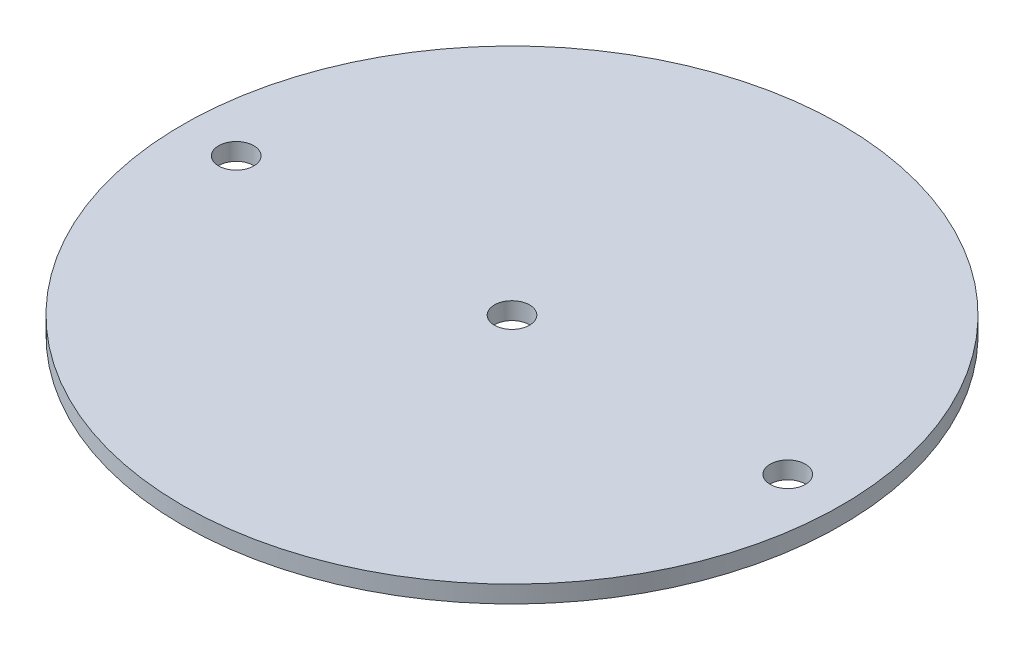
ISO-10303-21;
HEADER;
FILE_DESCRIPTION(('STEP AP214'),'2;1');
FILE_NAME('part.step','',(''),(''),'','','');
FILE_SCHEMA(('AUTOMOTIVE_DESIGN { 1 0 10303 214 1 1 1 1 }'));
ENDSEC;
DATA;
#1=APPLICATION_CONTEXT('core data for automotive mechanical design processes');
#2=APPLICATION_PROTOCOL_DEFINITION('international standard','automotive_design',2000,#1);
#3=PRODUCT_CONTEXT('',#1,'mechanical');
#4=PRODUCT('Part','Part','',(#3));
#5=PRODUCT_RELATED_PRODUCT_CATEGORY('part','',(#4));
#6=PRODUCT_DEFINITION_FORMATION('','',#4);
#7=PRODUCT_DEFINITION_CONTEXT('part definition',#1,'design');
#8=PRODUCT_DEFINITION('design','',#6,#7);
#9=PRODUCT_DEFINITION_SHAPE('','',#8);
#10=(LENGTH_UNIT() NAMED_UNIT(*) SI_UNIT(.MILLI.,.METRE.));
#11=(NAMED_UNIT(*) PLANE_ANGLE_UNIT() SI_UNIT($,.RADIAN.));
#12=(NAMED_UNIT(*) SI_UNIT($,.STERADIAN.) SOLID_ANGLE_UNIT());
#13=UNCERTAINTY_MEASURE_WITH_UNIT(LENGTH_MEASURE(1.E-05),#10,'distance_accuracy_value','');
#14=(GEOMETRIC_REPRESENTATION_CONTEXT(3) GLOBAL_UNCERTAINTY_ASSIGNED_CONTEXT((#13)) GLOBAL_UNIT_ASSIGNED_CONTEXT((#10,
#11,#12)) REPRESENTATION_CONTEXT('',''));
#15=CARTESIAN_POINT('',(0.,0.,0.));
#16=DIRECTION('',(0.,0.,1.));
#17=DIRECTION('',(1.,0.,0.));
#18=AXIS2_PLACEMENT_3D('',#15,#16,#17);
#19=CARTESIAN_POINT('',(0.,3.175,0.));
#20=DIRECTION('',(0.,1.,0.));
#21=DIRECTION('',(0.,0.,1.));
#22=AXIS2_PLACEMENT_3D('',#19,#20,#21);
#23=PLANE('',#22);
#24=CARTESIAN_POINT('',(50.8,3.175,0.));
#25=DIRECTION('',(0.,1.,0.));
#26=DIRECTION('',(0.,0.,1.));
#27=AXIS2_PLACEMENT_3D('',#24,#25,#26);
#28=CIRCLE('',#27,3.2385);
#29=CARTESIAN_POINT('',(50.8,3.175,3.23849999999998));
#30=VERTEX_POINT('',#29);
#31=EDGE_CURVE('E60',#30,#30,#28,.T.);
#32=ORIENTED_EDGE('',*,*,#31,.F.);
#33=EDGE_LOOP('',(#32));
#34=FACE_BOUND('',#33,.T.);
#35=CARTESIAN_POINT('',(0.,3.175,0.));
#36=DIRECTION('',(0.,1.,0.));
#37=DIRECTION('',(0.,0.,1.));
#38=AXIS2_PLACEMENT_3D('',#35,#36,#37);
#39=CIRCLE('',#38,60.706);
#40=CARTESIAN_POINT('',(0.,3.175,60.706));
#41=VERTEX_POINT('',#40);
#42=EDGE_CURVE('E10',#41,#41,#39,.T.);
#43=ORIENTED_EDGE('',*,*,#42,.T.);
#44=EDGE_LOOP('',(#43));
#45=FACE_BOUND('',#44,.T.);
#46=CARTESIAN_POINT('',(-50.8,3.175,0.));
#47=DIRECTION('',(0.,1.,0.));
#48=DIRECTION('',(0.,0.,1.));
#49=AXIS2_PLACEMENT_3D('',#46,#47,#48);
#50=CIRCLE('',#49,3.2385);
#51=CARTESIAN_POINT('',(-50.8,3.175,3.2385));
#52=VERTEX_POINT('',#51);
#53=EDGE_CURVE('E54',#52,#52,#50,.T.);
#54=ORIENTED_EDGE('',*,*,#53,.F.);
#55=EDGE_LOOP('',(#54));
#56=FACE_BOUND('',#55,.T.);
#57=CARTESIAN_POINT('',(0.,3.175,0.));
#58=DIRECTION('',(0.,1.,0.));
#59=DIRECTION('',(0.,0.,1.));
#60=AXIS2_PLACEMENT_3D('',#57,#58,#59);
#61=CIRCLE('',#60,3.2385);
#62=CARTESIAN_POINT('',(0.,3.175,3.2385));
#63=VERTEX_POINT('',#62);
#64=EDGE_CURVE('E68',#63,#63,#61,.T.);
#65=ORIENTED_EDGE('',*,*,#64,.F.);
#66=EDGE_LOOP('',(#65));
#67=FACE_BOUND('',#66,.T.);
#68=ADVANCED_FACE('F41',(#34,#45,#56,#67),#23,.T.);
#69=CARTESIAN_POINT('',(0.,0.,0.));
#70=DIRECTION('',(0.,1.,0.));
#71=DIRECTION('',(0.,0.,1.));
#72=AXIS2_PLACEMENT_3D('',#69,#70,#71);
#73=PLANE('',#72);
#74=CARTESIAN_POINT('',(0.,0.,0.));
#75=DIRECTION('',(0.,1.,0.));
#76=DIRECTION('',(0.,0.,1.));
#77=AXIS2_PLACEMENT_3D('',#74,#75,#76);
#78=CIRCLE('',#77,60.706);
#79=CARTESIAN_POINT('',(0.,0.,60.706));
#80=VERTEX_POINT('',#79);
#81=EDGE_CURVE('E45',#80,#80,#78,.T.);
#82=ORIENTED_EDGE('',*,*,#81,.F.);
#83=EDGE_LOOP('',(#82));
#84=FACE_BOUND('',#83,.T.);
#85=CARTESIAN_POINT('',(-50.8,0.,0.));
#86=DIRECTION('',(0.,1.,0.));
#87=DIRECTION('',(0.,0.,1.));
#88=AXIS2_PLACEMENT_3D('',#85,#86,#87);
#89=CIRCLE('',#88,3.2385);
#90=CARTESIAN_POINT('',(-50.8,0.,3.2385));
#91=VERTEX_POINT('',#90);
#92=EDGE_CURVE('E56',#91,#91,#89,.T.);
#93=ORIENTED_EDGE('',*,*,#92,.T.);
#94=EDGE_LOOP('',(#93));
#95=FACE_BOUND('',#94,.T.);
#96=CARTESIAN_POINT('',(50.8,0.,0.));
#97=DIRECTION('',(0.,1.,0.));
#98=DIRECTION('',(0.,0.,1.));
#99=AXIS2_PLACEMENT_3D('',#96,#97,#98);
#100=CIRCLE('',#99,3.2385);
#101=CARTESIAN_POINT('',(50.8,0.,3.23849999999998));
#102=VERTEX_POINT('',#101);
#103=EDGE_CURVE('E64',#102,#102,#100,.T.);
#104=ORIENTED_EDGE('',*,*,#103,.T.);
#105=EDGE_LOOP('',(#104));
#106=FACE_BOUND('',#105,.T.);
#107=CARTESIAN_POINT('',(0.,0.,0.));
#108=DIRECTION('',(0.,1.,0.));
#109=DIRECTION('',(0.,0.,1.));
#110=AXIS2_PLACEMENT_3D('',#107,#108,#109);
#111=CIRCLE('',#110,3.2385);
#112=CARTESIAN_POINT('',(0.,0.,3.2385));
#113=VERTEX_POINT('',#112);
#114=EDGE_CURVE('E72',#113,#113,#111,.T.);
#115=ORIENTED_EDGE('',*,*,#114,.T.);
#116=EDGE_LOOP('',(#115));
#117=FACE_BOUND('',#116,.T.);
#118=ADVANCED_FACE('F84',(#84,#95,#106,#117),#73,.F.);
#119=CARTESIAN_POINT('',(0.,3.175,0.));
#120=DIRECTION('',(0.,-1.,0.));
#121=DIRECTION('',(0.,0.,-1.));
#122=AXIS2_PLACEMENT_3D('',#119,#120,#121);
#123=CYLINDRICAL_SURFACE('',#122,60.706);
#124=ORIENTED_EDGE('',*,*,#42,.F.);
#125=EDGE_LOOP('',(#124));
#126=FACE_BOUND('',#125,.T.);
#127=ORIENTED_EDGE('',*,*,#81,.T.);
#128=EDGE_LOOP('',(#127));
#129=FACE_BOUND('',#128,.T.);
#130=ADVANCED_FACE('F43',(#126,#129),#123,.T.);
#131=CARTESIAN_POINT('',(-50.8,3.175,0.));
#132=DIRECTION('',(0.,-1.,0.));
#133=DIRECTION('',(0.,0.,-1.));
#134=AXIS2_PLACEMENT_3D('',#131,#132,#133);
#135=CYLINDRICAL_SURFACE('',#134,3.2385);
#136=ORIENTED_EDGE('',*,*,#53,.T.);
#137=EDGE_LOOP('',(#136));
#138=FACE_BOUND('',#137,.T.);
#139=ORIENTED_EDGE('',*,*,#92,.F.);
#140=EDGE_LOOP('',(#139));
#141=FACE_BOUND('',#140,.T.);
#142=ADVANCED_FACE('F93',(#138,#141),#135,.F.);
#143=CARTESIAN_POINT('',(50.8,3.175,0.));
#144=DIRECTION('',(0.,-1.,0.));
#145=DIRECTION('',(0.,0.,-1.));
#146=AXIS2_PLACEMENT_3D('',#143,#144,#145);
#147=CYLINDRICAL_SURFACE('',#146,3.2385);
#148=ORIENTED_EDGE('',*,*,#31,.T.);
#149=EDGE_LOOP('',(#148));
#150=FACE_BOUND('',#149,.T.);
#151=ORIENTED_EDGE('',*,*,#103,.F.);
#152=EDGE_LOOP('',(#151));
#153=FACE_BOUND('',#152,.T.);
#154=ADVANCED_FACE('F96',(#150,#153),#147,.F.);
#155=CARTESIAN_POINT('',(0.,3.175,0.));
#156=DIRECTION('',(0.,-1.,0.));
#157=DIRECTION('',(0.,0.,-1.));
#158=AXIS2_PLACEMENT_3D('',#155,#156,#157);
#159=CYLINDRICAL_SURFACE('',#158,3.2385);
#160=ORIENTED_EDGE('',*,*,#64,.T.);
#161=EDGE_LOOP('',(#160));
#162=FACE_BOUND('',#161,.T.);
#163=ORIENTED_EDGE('',*,*,#114,.F.);
#164=EDGE_LOOP('',(#163));
#165=FACE_BOUND('',#164,.T.);
#166=ADVANCED_FACE('F80',(#162,#165),#159,.F.);
#167=CLOSED_SHELL('',(#68,#118,#130,#142,#154,#166));
#168=MANIFOLD_SOLID_BREP('B2',#167);
#169=ADVANCED_BREP_SHAPE_REPRESENTATION('',(#18,#168),#14);
#170=SHAPE_DEFINITION_REPRESENTATION(#9,#169);
ENDSEC;
END-ISO-10303-21;
